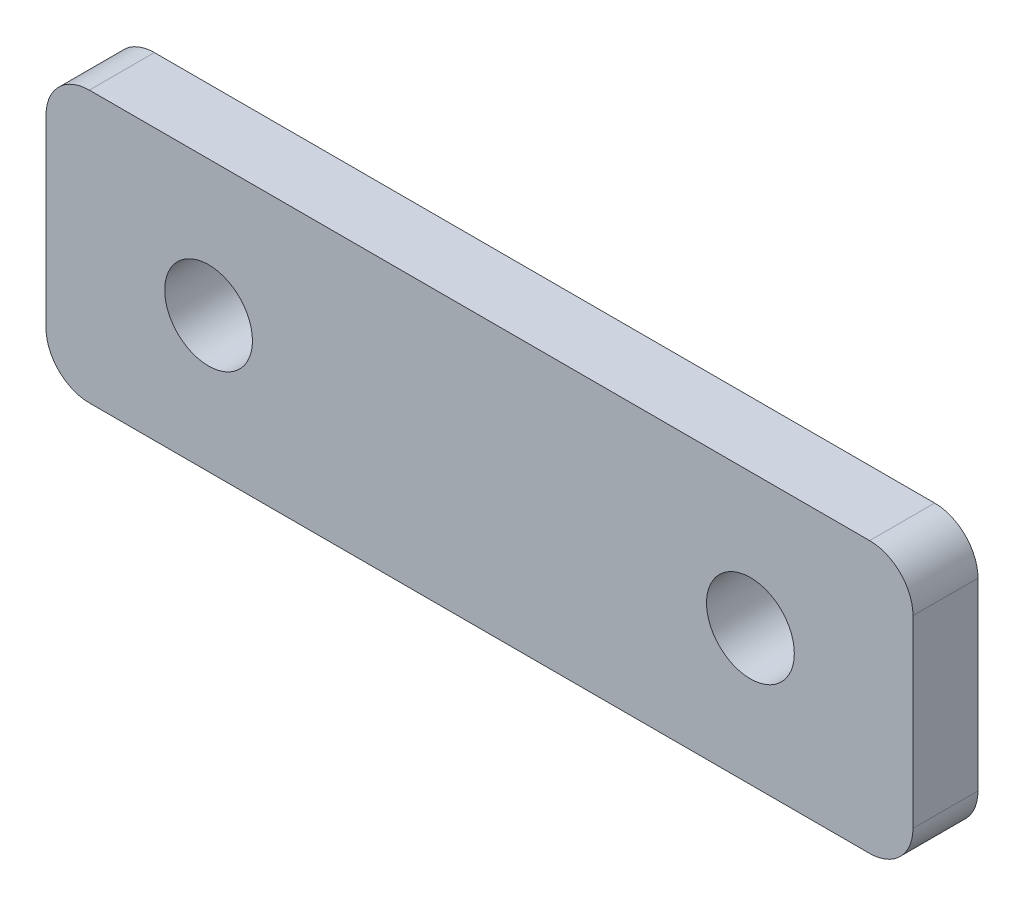
ISO-10303-21;
HEADER;
FILE_DESCRIPTION(('STEP AP214'),'2;1');
FILE_NAME('part.step','',(''),(''),'','','');
FILE_SCHEMA(('AUTOMOTIVE_DESIGN { 1 0 10303 214 1 1 1 1 }'));
ENDSEC;
DATA;
#1=APPLICATION_CONTEXT('core data for automotive mechanical design processes');
#2=APPLICATION_PROTOCOL_DEFINITION('international standard','automotive_design',2000,#1);
#3=PRODUCT_CONTEXT('',#1,'mechanical');
#4=PRODUCT('Part','Part','',(#3));
#5=PRODUCT_RELATED_PRODUCT_CATEGORY('part','',(#4));
#6=PRODUCT_DEFINITION_FORMATION('','',#4);
#7=PRODUCT_DEFINITION_CONTEXT('part definition',#1,'design');
#8=PRODUCT_DEFINITION('design','',#6,#7);
#9=PRODUCT_DEFINITION_SHAPE('','',#8);
#10=(LENGTH_UNIT() NAMED_UNIT(*) SI_UNIT(.MILLI.,.METRE.));
#11=(NAMED_UNIT(*) PLANE_ANGLE_UNIT() SI_UNIT($,.RADIAN.));
#12=(NAMED_UNIT(*) SI_UNIT($,.STERADIAN.) SOLID_ANGLE_UNIT());
#13=UNCERTAINTY_MEASURE_WITH_UNIT(LENGTH_MEASURE(1.E-05),#10,'distance_accuracy_value','');
#14=(GEOMETRIC_REPRESENTATION_CONTEXT(3) GLOBAL_UNCERTAINTY_ASSIGNED_CONTEXT((#13)) GLOBAL_UNIT_ASSIGNED_CONTEXT((#10,
#11,#12)) REPRESENTATION_CONTEXT('',''));
#15=CARTESIAN_POINT('',(0.,0.,0.));
#16=DIRECTION('',(0.,0.,1.));
#17=DIRECTION('',(1.,0.,0.));
#18=AXIS2_PLACEMENT_3D('',#15,#16,#17);
#19=CARTESIAN_POINT('',(0.,0.,1.5));
#20=DIRECTION('',(0.,0.,-1.));
#21=DIRECTION('',(-1.,0.,0.));
#22=AXIS2_PLACEMENT_3D('',#19,#20,#21);
#23=PLANE('',#22);
#24=DIRECTION('',(0.,-1.,0.));
#25=VECTOR('',#24,1.);
#26=CARTESIAN_POINT('',(-20.,-6.25,1.5));
#27=LINE('',#26,#25);
#28=CARTESIAN_POINT('',(-20.,4.25,1.5));
#29=VERTEX_POINT('',#28);
#30=CARTESIAN_POINT('',(-20.,-4.25,1.5));
#31=VERTEX_POINT('',#30);
#32=EDGE_CURVE('E174',#29,#31,#27,.T.);
#33=ORIENTED_EDGE('',*,*,#32,.T.);
#34=CARTESIAN_POINT('',(-18.,-4.25,1.5));
#35=DIRECTION('',(0.,0.,-1.));
#36=DIRECTION('',(-1.,0.,0.));
#37=AXIS2_PLACEMENT_3D('',#34,#35,#36);
#38=CIRCLE('',#37,2.);
#39=CARTESIAN_POINT('',(-18.,-6.25,1.5));
#40=VERTEX_POINT('',#39);
#41=EDGE_CURVE('E151',#31,#40,#38,.F.);
#42=ORIENTED_EDGE('',*,*,#41,.T.);
#43=DIRECTION('',(1.,0.,0.));
#44=VECTOR('',#43,1.);
#45=CARTESIAN_POINT('',(-20.,-6.25,1.5));
#46=LINE('',#45,#44);
#47=CARTESIAN_POINT('',(18.,-6.25,1.5));
#48=VERTEX_POINT('',#47);
#49=EDGE_CURVE('E122',#40,#48,#46,.T.);
#50=ORIENTED_EDGE('',*,*,#49,.T.);
#51=CARTESIAN_POINT('',(18.,-4.25,1.5));
#52=DIRECTION('',(0.,0.,-1.));
#53=DIRECTION('',(-1.,0.,0.));
#54=AXIS2_PLACEMENT_3D('',#51,#52,#53);
#55=CIRCLE('',#54,2.);
#56=CARTESIAN_POINT('',(20.,-4.25,1.5));
#57=VERTEX_POINT('',#56);
#58=EDGE_CURVE('E147',#48,#57,#55,.F.);
#59=ORIENTED_EDGE('',*,*,#58,.T.);
#60=DIRECTION('',(0.,1.,0.));
#61=VECTOR('',#60,1.);
#62=CARTESIAN_POINT('',(20.,-6.25,1.5));
#63=LINE('',#62,#61);
#64=CARTESIAN_POINT('',(20.,4.25,1.5));
#65=VERTEX_POINT('',#64);
#66=EDGE_CURVE('E130',#57,#65,#63,.T.);
#67=ORIENTED_EDGE('',*,*,#66,.T.);
#68=CARTESIAN_POINT('',(18.,4.25,1.5));
#69=DIRECTION('',(0.,0.,-1.));
#70=DIRECTION('',(-1.,0.,0.));
#71=AXIS2_PLACEMENT_3D('',#68,#69,#70);
#72=CIRCLE('',#71,2.);
#73=CARTESIAN_POINT('',(18.,6.25,1.5));
#74=VERTEX_POINT('',#73);
#75=EDGE_CURVE('E57',#65,#74,#72,.F.);
#76=ORIENTED_EDGE('',*,*,#75,.T.);
#77=DIRECTION('',(-1.,0.,0.));
#78=VECTOR('',#77,1.);
#79=CARTESIAN_POINT('',(-20.,6.25,1.5));
#80=LINE('',#79,#78);
#81=CARTESIAN_POINT('',(-18.,6.25,1.5));
#82=VERTEX_POINT('',#81);
#83=EDGE_CURVE('E133',#74,#82,#80,.T.);
#84=ORIENTED_EDGE('',*,*,#83,.T.);
#85=CARTESIAN_POINT('',(-18.,4.25,1.5));
#86=DIRECTION('',(0.,0.,-1.));
#87=DIRECTION('',(-1.,0.,0.));
#88=AXIS2_PLACEMENT_3D('',#85,#86,#87);
#89=CIRCLE('',#88,2.);
#90=EDGE_CURVE('E149',#82,#29,#89,.F.);
#91=ORIENTED_EDGE('',*,*,#90,.T.);
#92=EDGE_LOOP('',(#33,#42,#50,#59,#67,#76,#84,#91));
#93=FACE_BOUND('',#92,.T.);
#94=CARTESIAN_POINT('',(-12.5,0.,1.5));
#95=DIRECTION('',(0.,0.,1.));
#96=DIRECTION('',(1.,0.,0.));
#97=AXIS2_PLACEMENT_3D('',#94,#95,#96);
#98=CIRCLE('',#97,2.025);
#99=CARTESIAN_POINT('',(-10.475,0.,1.5));
#100=VERTEX_POINT('',#99);
#101=EDGE_CURVE('E170',#100,#100,#98,.T.);
#102=ORIENTED_EDGE('',*,*,#101,.F.);
#103=EDGE_LOOP('',(#102));
#104=FACE_BOUND('',#103,.T.);
#105=CARTESIAN_POINT('',(12.5,0.,1.5));
#106=DIRECTION('',(0.,0.,1.));
#107=DIRECTION('',(1.,0.,0.));
#108=AXIS2_PLACEMENT_3D('',#105,#106,#107);
#109=CIRCLE('',#108,2.025);
#110=CARTESIAN_POINT('',(14.525,0.,1.5));
#111=VERTEX_POINT('',#110);
#112=EDGE_CURVE('E180',#111,#111,#109,.T.);
#113=ORIENTED_EDGE('',*,*,#112,.F.);
#114=EDGE_LOOP('',(#113));
#115=FACE_BOUND('',#114,.T.);
#116=ADVANCED_FACE('F35',(#93,#104,#115),#23,.F.);
#117=CARTESIAN_POINT('',(0.,0.,-1.5));
#118=DIRECTION('',(0.,0.,-1.));
#119=DIRECTION('',(-1.,0.,0.));
#120=AXIS2_PLACEMENT_3D('',#117,#118,#119);
#121=PLANE('',#120);
#122=CARTESIAN_POINT('',(-12.5,0.,-1.5));
#123=DIRECTION('',(0.,0.,1.));
#124=DIRECTION('',(1.,0.,0.));
#125=AXIS2_PLACEMENT_3D('',#122,#123,#124);
#126=CIRCLE('',#125,2.025);
#127=CARTESIAN_POINT('',(-10.475,0.,-1.5));
#128=VERTEX_POINT('',#127);
#129=EDGE_CURVE('E177',#128,#128,#126,.T.);
#130=ORIENTED_EDGE('',*,*,#129,.T.);
#131=EDGE_LOOP('',(#130));
#132=FACE_BOUND('',#131,.T.);
#133=DIRECTION('',(1.,0.,0.));
#134=VECTOR('',#133,1.);
#135=CARTESIAN_POINT('',(-20.,-6.25,-1.5));
#136=LINE('',#135,#134);
#137=CARTESIAN_POINT('',(-18.,-6.25,-1.5));
#138=VERTEX_POINT('',#137);
#139=CARTESIAN_POINT('',(18.,-6.25,-1.5));
#140=VERTEX_POINT('',#139);
#141=EDGE_CURVE('E119',#138,#140,#136,.T.);
#142=ORIENTED_EDGE('',*,*,#141,.F.);
#143=CARTESIAN_POINT('',(-18.,-4.25,-1.5));
#144=DIRECTION('',(0.,0.,-1.));
#145=DIRECTION('',(-1.,0.,0.));
#146=AXIS2_PLACEMENT_3D('',#143,#144,#145);
#147=CIRCLE('',#146,2.);
#148=CARTESIAN_POINT('',(-20.,-4.25,-1.5));
#149=VERTEX_POINT('',#148);
#150=EDGE_CURVE('E102',#138,#149,#147,.T.);
#151=ORIENTED_EDGE('',*,*,#150,.T.);
#152=DIRECTION('',(0.,-1.,0.));
#153=VECTOR('',#152,1.);
#154=CARTESIAN_POINT('',(-20.,-6.25,-1.5));
#155=LINE('',#154,#153);
#156=CARTESIAN_POINT('',(-20.,4.25,-1.5));
#157=VERTEX_POINT('',#156);
#158=EDGE_CURVE('E131',#157,#149,#155,.T.);
#159=ORIENTED_EDGE('',*,*,#158,.F.);
#160=CARTESIAN_POINT('',(-18.,4.25,-1.5));
#161=DIRECTION('',(0.,0.,-1.));
#162=DIRECTION('',(-1.,0.,0.));
#163=AXIS2_PLACEMENT_3D('',#160,#161,#162);
#164=CIRCLE('',#163,2.);
#165=CARTESIAN_POINT('',(-18.,6.25,-1.5));
#166=VERTEX_POINT('',#165);
#167=EDGE_CURVE('E113',#157,#166,#164,.T.);
#168=ORIENTED_EDGE('',*,*,#167,.T.);
#169=DIRECTION('',(-1.,0.,0.));
#170=VECTOR('',#169,1.);
#171=CARTESIAN_POINT('',(-20.,6.25,-1.5));
#172=LINE('',#171,#170);
#173=CARTESIAN_POINT('',(18.,6.25,-1.5));
#174=VERTEX_POINT('',#173);
#175=EDGE_CURVE('E135',#174,#166,#172,.T.);
#176=ORIENTED_EDGE('',*,*,#175,.F.);
#177=CARTESIAN_POINT('',(18.,4.25,-1.5));
#178=DIRECTION('',(0.,0.,-1.));
#179=DIRECTION('',(-1.,0.,0.));
#180=AXIS2_PLACEMENT_3D('',#177,#178,#179);
#181=CIRCLE('',#180,2.);
#182=CARTESIAN_POINT('',(20.,4.25,-1.5));
#183=VERTEX_POINT('',#182);
#184=EDGE_CURVE('E123',#174,#183,#181,.T.);
#185=ORIENTED_EDGE('',*,*,#184,.T.);
#186=DIRECTION('',(0.,1.,0.));
#187=VECTOR('',#186,1.);
#188=CARTESIAN_POINT('',(20.,-6.25,-1.5));
#189=LINE('',#188,#187);
#190=CARTESIAN_POINT('',(20.,-4.25,-1.5));
#191=VERTEX_POINT('',#190);
#192=EDGE_CURVE('E162',#191,#183,#189,.T.);
#193=ORIENTED_EDGE('',*,*,#192,.F.);
#194=CARTESIAN_POINT('',(18.,-4.25,-1.5));
#195=DIRECTION('',(0.,0.,-1.));
#196=DIRECTION('',(-1.,0.,0.));
#197=AXIS2_PLACEMENT_3D('',#194,#195,#196);
#198=CIRCLE('',#197,2.);
#199=EDGE_CURVE('E129',#191,#140,#198,.T.);
#200=ORIENTED_EDGE('',*,*,#199,.T.);
#201=EDGE_LOOP('',(#142,#151,#159,#168,#176,#185,#193,#200));
#202=FACE_BOUND('',#201,.T.);
#203=CARTESIAN_POINT('',(12.5,0.,-1.5));
#204=DIRECTION('',(0.,0.,1.));
#205=DIRECTION('',(1.,0.,0.));
#206=AXIS2_PLACEMENT_3D('',#203,#204,#205);
#207=CIRCLE('',#206,2.025);
#208=CARTESIAN_POINT('',(14.525,0.,-1.5));
#209=VERTEX_POINT('',#208);
#210=EDGE_CURVE('E183',#209,#209,#207,.T.);
#211=ORIENTED_EDGE('',*,*,#210,.T.);
#212=EDGE_LOOP('',(#211));
#213=FACE_BOUND('',#212,.T.);
#214=ADVANCED_FACE('F126',(#132,#202,#213),#121,.T.);
#215=CARTESIAN_POINT('',(20.,-6.25,1.5));
#216=DIRECTION('',(-1.,0.,0.));
#217=DIRECTION('',(0.,0.,1.));
#218=AXIS2_PLACEMENT_3D('',#215,#216,#217);
#219=PLANE('',#218);
#220=ORIENTED_EDGE('',*,*,#66,.F.);
#221=DIRECTION('',(0.,0.,-1.));
#222=VECTOR('',#221,1.);
#223=CARTESIAN_POINT('',(20.,-4.25,1.5));
#224=LINE('',#223,#222);
#225=EDGE_CURVE('E11',#57,#191,#224,.T.);
#226=ORIENTED_EDGE('',*,*,#225,.T.);
#227=ORIENTED_EDGE('',*,*,#192,.T.);
#228=DIRECTION('',(0.,0.,-1.));
#229=VECTOR('',#228,1.);
#230=CARTESIAN_POINT('',(20.,4.25,1.5));
#231=LINE('',#230,#229);
#232=EDGE_CURVE('E43',#183,#65,#231,.F.);
#233=ORIENTED_EDGE('',*,*,#232,.T.);
#234=EDGE_LOOP('',(#220,#226,#227,#233));
#235=FACE_BOUND('',#234,.T.);
#236=ADVANCED_FACE('F160',(#235),#219,.F.);
#237=CARTESIAN_POINT('',(-20.,6.25,1.5));
#238=DIRECTION('',(0.,-1.,0.));
#239=DIRECTION('',(0.,0.,-1.));
#240=AXIS2_PLACEMENT_3D('',#237,#238,#239);
#241=PLANE('',#240);
#242=ORIENTED_EDGE('',*,*,#175,.T.);
#243=DIRECTION('',(0.,0.,-1.));
#244=VECTOR('',#243,1.);
#245=CARTESIAN_POINT('',(-18.,6.25,1.5));
#246=LINE('',#245,#244);
#247=EDGE_CURVE('E50',#166,#82,#246,.F.);
#248=ORIENTED_EDGE('',*,*,#247,.T.);
#249=ORIENTED_EDGE('',*,*,#83,.F.);
#250=DIRECTION('',(0.,0.,-1.));
#251=VECTOR('',#250,1.);
#252=CARTESIAN_POINT('',(18.,6.25,1.5));
#253=LINE('',#252,#251);
#254=EDGE_CURVE('E153',#74,#174,#253,.T.);
#255=ORIENTED_EDGE('',*,*,#254,.T.);
#256=EDGE_LOOP('',(#242,#248,#249,#255));
#257=FACE_BOUND('',#256,.T.);
#258=ADVANCED_FACE('F169',(#257),#241,.F.);
#259=CARTESIAN_POINT('',(-20.,-6.25,1.5));
#260=DIRECTION('',(1.,0.,0.));
#261=DIRECTION('',(0.,1.,0.));
#262=AXIS2_PLACEMENT_3D('',#259,#260,#261);
#263=PLANE('',#262);
#264=ORIENTED_EDGE('',*,*,#158,.T.);
#265=DIRECTION('',(0.,0.,-1.));
#266=VECTOR('',#265,1.);
#267=CARTESIAN_POINT('',(-20.,-4.25,1.5));
#268=LINE('',#267,#266);
#269=EDGE_CURVE('E107',#149,#31,#268,.F.);
#270=ORIENTED_EDGE('',*,*,#269,.T.);
#271=ORIENTED_EDGE('',*,*,#32,.F.);
#272=DIRECTION('',(0.,0.,-1.));
#273=VECTOR('',#272,1.);
#274=CARTESIAN_POINT('',(-20.,4.25,1.5));
#275=LINE('',#274,#273);
#276=EDGE_CURVE('E112',#29,#157,#275,.T.);
#277=ORIENTED_EDGE('',*,*,#276,.T.);
#278=EDGE_LOOP('',(#264,#270,#271,#277));
#279=FACE_BOUND('',#278,.T.);
#280=ADVANCED_FACE('F205',(#279),#263,.F.);
#281=CARTESIAN_POINT('',(-20.,-6.25,1.5));
#282=DIRECTION('',(0.,1.,0.));
#283=DIRECTION('',(0.,0.,1.));
#284=AXIS2_PLACEMENT_3D('',#281,#282,#283);
#285=PLANE('',#284);
#286=ORIENTED_EDGE('',*,*,#49,.F.);
#287=DIRECTION('',(0.,0.,-1.));
#288=VECTOR('',#287,1.);
#289=CARTESIAN_POINT('',(-18.,-6.25,1.5));
#290=LINE('',#289,#288);
#291=EDGE_CURVE('E106',#40,#138,#290,.T.);
#292=ORIENTED_EDGE('',*,*,#291,.T.);
#293=ORIENTED_EDGE('',*,*,#141,.T.);
#294=DIRECTION('',(0.,0.,-1.));
#295=VECTOR('',#294,1.);
#296=CARTESIAN_POINT('',(18.,-6.25,1.5));
#297=LINE('',#296,#295);
#298=EDGE_CURVE('E124',#140,#48,#297,.F.);
#299=ORIENTED_EDGE('',*,*,#298,.T.);
#300=EDGE_LOOP('',(#286,#292,#293,#299));
#301=FACE_BOUND('',#300,.T.);
#302=ADVANCED_FACE('F118',(#301),#285,.F.);
#303=CARTESIAN_POINT('',(-12.5,0.,1.5));
#304=DIRECTION('',(0.,0.,-1.));
#305=DIRECTION('',(-1.,0.,0.));
#306=AXIS2_PLACEMENT_3D('',#303,#304,#305);
#307=CYLINDRICAL_SURFACE('',#306,2.025);
#308=ORIENTED_EDGE('',*,*,#101,.T.);
#309=EDGE_LOOP('',(#308));
#310=FACE_BOUND('',#309,.T.);
#311=ORIENTED_EDGE('',*,*,#129,.F.);
#312=EDGE_LOOP('',(#311));
#313=FACE_BOUND('',#312,.T.);
#314=ADVANCED_FACE('F200',(#310,#313),#307,.F.);
#315=CARTESIAN_POINT('',(12.5,0.,1.5));
#316=DIRECTION('',(0.,0.,-1.));
#317=DIRECTION('',(-1.,0.,0.));
#318=AXIS2_PLACEMENT_3D('',#315,#316,#317);
#319=CYLINDRICAL_SURFACE('',#318,2.025);
#320=ORIENTED_EDGE('',*,*,#112,.T.);
#321=EDGE_LOOP('',(#320));
#322=FACE_BOUND('',#321,.T.);
#323=ORIENTED_EDGE('',*,*,#210,.F.);
#324=EDGE_LOOP('',(#323));
#325=FACE_BOUND('',#324,.T.);
#326=ADVANCED_FACE('F189',(#322,#325),#319,.F.);
#327=CARTESIAN_POINT('',(-18.,-4.25,1.5));
#328=DIRECTION('',(0.,0.,-1.));
#329=DIRECTION('',(-1.,0.,0.));
#330=AXIS2_PLACEMENT_3D('',#327,#328,#329);
#331=CYLINDRICAL_SURFACE('',#330,2.);
#332=ORIENTED_EDGE('',*,*,#41,.F.);
#333=ORIENTED_EDGE('',*,*,#269,.F.);
#334=ORIENTED_EDGE('',*,*,#150,.F.);
#335=ORIENTED_EDGE('',*,*,#291,.F.);
#336=EDGE_LOOP('',(#332,#333,#334,#335));
#337=FACE_BOUND('',#336,.T.);
#338=ADVANCED_FACE('F105',(#337),#331,.T.);
#339=CARTESIAN_POINT('',(-18.,4.25,1.5));
#340=DIRECTION('',(0.,0.,-1.));
#341=DIRECTION('',(-1.,0.,0.));
#342=AXIS2_PLACEMENT_3D('',#339,#340,#341);
#343=CYLINDRICAL_SURFACE('',#342,2.);
#344=ORIENTED_EDGE('',*,*,#90,.F.);
#345=ORIENTED_EDGE('',*,*,#247,.F.);
#346=ORIENTED_EDGE('',*,*,#167,.F.);
#347=ORIENTED_EDGE('',*,*,#276,.F.);
#348=EDGE_LOOP('',(#344,#345,#346,#347));
#349=FACE_BOUND('',#348,.T.);
#350=ADVANCED_FACE('F215',(#349),#343,.T.);
#351=CARTESIAN_POINT('',(18.,-4.25,1.5));
#352=DIRECTION('',(0.,0.,-1.));
#353=DIRECTION('',(-1.,0.,0.));
#354=AXIS2_PLACEMENT_3D('',#351,#352,#353);
#355=CYLINDRICAL_SURFACE('',#354,2.);
#356=ORIENTED_EDGE('',*,*,#58,.F.);
#357=ORIENTED_EDGE('',*,*,#298,.F.);
#358=ORIENTED_EDGE('',*,*,#199,.F.);
#359=ORIENTED_EDGE('',*,*,#225,.F.);
#360=EDGE_LOOP('',(#356,#357,#358,#359));
#361=FACE_BOUND('',#360,.T.);
#362=ADVANCED_FACE('F217',(#361),#355,.T.);
#363=CARTESIAN_POINT('',(18.,4.25,1.5));
#364=DIRECTION('',(0.,0.,-1.));
#365=DIRECTION('',(-1.,0.,0.));
#366=AXIS2_PLACEMENT_3D('',#363,#364,#365);
#367=CYLINDRICAL_SURFACE('',#366,2.);
#368=ORIENTED_EDGE('',*,*,#75,.F.);
#369=ORIENTED_EDGE('',*,*,#232,.F.);
#370=ORIENTED_EDGE('',*,*,#184,.F.);
#371=ORIENTED_EDGE('',*,*,#254,.F.);
#372=EDGE_LOOP('',(#368,#369,#370,#371));
#373=FACE_BOUND('',#372,.T.);
#374=ADVANCED_FACE('F37',(#373),#367,.T.);
#375=CLOSED_SHELL('',(#116,#214,#236,#258,#280,#302,#314,#326,#338,#350,#362,#374));
#376=MANIFOLD_SOLID_BREP('B2',#375);
#377=ADVANCED_BREP_SHAPE_REPRESENTATION('',(#18,#376),#14);
#378=SHAPE_DEFINITION_REPRESENTATION(#9,#377);
ENDSEC;
END-ISO-10303-21;
